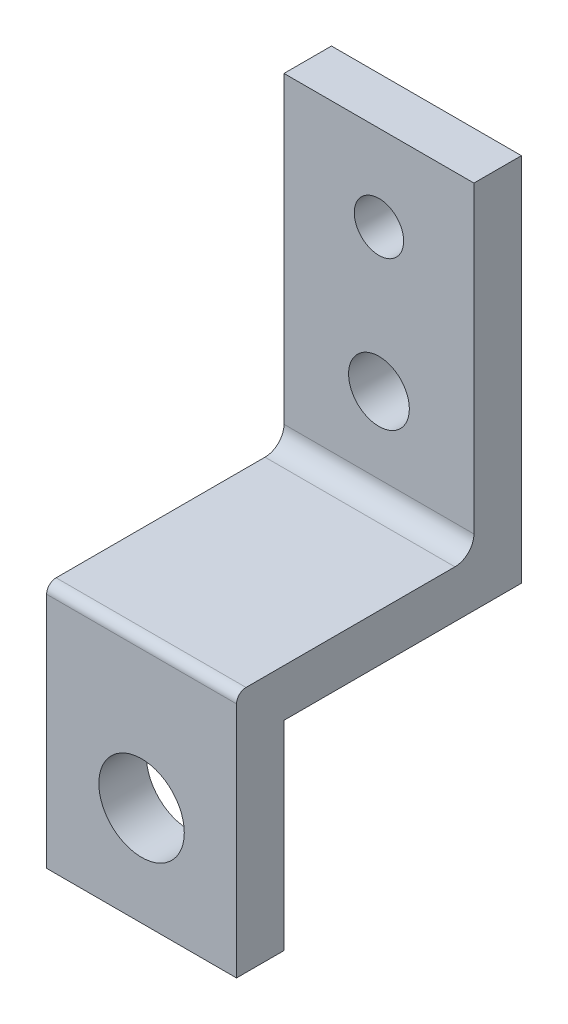
ISO-10303-21;
HEADER;
FILE_DESCRIPTION(('STEP AP214'),'2;1');
FILE_NAME('part.step','',(''),(''),'','','');
FILE_SCHEMA(('AUTOMOTIVE_DESIGN { 1 0 10303 214 1 1 1 1 }'));
ENDSEC;
DATA;
#1=APPLICATION_CONTEXT('core data for automotive mechanical design processes');
#2=APPLICATION_PROTOCOL_DEFINITION('international standard','automotive_design',2000,#1);
#3=PRODUCT_CONTEXT('',#1,'mechanical');
#4=PRODUCT('Part','Part','',(#3));
#5=PRODUCT_RELATED_PRODUCT_CATEGORY('part','',(#4));
#6=PRODUCT_DEFINITION_FORMATION('','',#4);
#7=PRODUCT_DEFINITION_CONTEXT('part definition',#1,'design');
#8=PRODUCT_DEFINITION('design','',#6,#7);
#9=PRODUCT_DEFINITION_SHAPE('','',#8);
#10=(LENGTH_UNIT() NAMED_UNIT(*) SI_UNIT(.MILLI.,.METRE.));
#11=(NAMED_UNIT(*) PLANE_ANGLE_UNIT() SI_UNIT($,.RADIAN.));
#12=(NAMED_UNIT(*) SI_UNIT($,.STERADIAN.) SOLID_ANGLE_UNIT());
#13=UNCERTAINTY_MEASURE_WITH_UNIT(LENGTH_MEASURE(1.E-05),#10,'distance_accuracy_value','');
#14=(GEOMETRIC_REPRESENTATION_CONTEXT(3) GLOBAL_UNCERTAINTY_ASSIGNED_CONTEXT((#13)) GLOBAL_UNIT_ASSIGNED_CONTEXT((#10,
#11,#12)) REPRESENTATION_CONTEXT('',''));
#15=CARTESIAN_POINT('',(0.,0.,0.));
#16=DIRECTION('',(0.,0.,1.));
#17=DIRECTION('',(1.,0.,0.));
#18=AXIS2_PLACEMENT_3D('',#15,#16,#17);
#19=CARTESIAN_POINT('',(0.,0.,0.));
#20=DIRECTION('',(0.,0.,1.));
#21=DIRECTION('',(1.,0.,0.));
#22=AXIS2_PLACEMENT_3D('',#19,#20,#21);
#23=PLANE('',#22);
#24=CARTESIAN_POINT('',(0.,-0.5,0.));
#25=DIRECTION('',(0.,0.,1.));
#26=DIRECTION('',(1.,0.,0.));
#27=AXIS2_PLACEMENT_3D('',#24,#25,#26);
#28=CIRCLE('',#27,4.5);
#29=CARTESIAN_POINT('',(4.5,-0.5,0.));
#30=VERTEX_POINT('',#29);
#31=EDGE_CURVE('E144',#30,#30,#28,.T.);
#32=ORIENTED_EDGE('',*,*,#31,.T.);
#33=EDGE_LOOP('',(#32));
#34=FACE_BOUND('',#33,.T.);
#35=DIRECTION('',(-1.,0.,0.));
#36=VECTOR('',#35,1.);
#37=CARTESIAN_POINT('',(10.,10.,0.));
#38=LINE('',#37,#36);
#39=CARTESIAN_POINT('',(10.,9.99999999999999,0.));
#40=VERTEX_POINT('',#39);
#41=CARTESIAN_POINT('',(-9.99999999999999,10.,0.));
#42=VERTEX_POINT('',#41);
#43=EDGE_CURVE('E127',#40,#42,#38,.T.);
#44=ORIENTED_EDGE('',*,*,#43,.F.);
#45=DIRECTION('',(0.,1.,0.));
#46=VECTOR('',#45,1.);
#47=CARTESIAN_POINT('',(10.,44.,0.));
#48=LINE('',#47,#46);
#49=CARTESIAN_POINT('',(10.,-11.,0.));
#50=VERTEX_POINT('',#49);
#51=EDGE_CURVE('E158',#50,#40,#48,.T.);
#52=ORIENTED_EDGE('',*,*,#51,.F.);
#53=DIRECTION('',(1.,0.,0.));
#54=VECTOR('',#53,1.);
#55=CARTESIAN_POINT('',(-10.,-11.,0.));
#56=LINE('',#55,#54);
#57=CARTESIAN_POINT('',(-10.,-11.,0.));
#58=VERTEX_POINT('',#57);
#59=EDGE_CURVE('E164',#58,#50,#56,.T.);
#60=ORIENTED_EDGE('',*,*,#59,.F.);
#61=DIRECTION('',(0.,-1.,0.));
#62=VECTOR('',#61,1.);
#63=CARTESIAN_POINT('',(-10.,-10.,0.));
#64=LINE('',#63,#62);
#65=EDGE_CURVE('E174',#42,#58,#64,.T.);
#66=ORIENTED_EDGE('',*,*,#65,.F.);
#67=EDGE_LOOP('',(#44,#52,#60,#66));
#68=FACE_BOUND('',#67,.T.);
#69=ADVANCED_FACE('F38',(#34,#68),#23,.F.);
#70=CARTESIAN_POINT('',(0.,0.,5.));
#71=DIRECTION('',(0.,0.,1.));
#72=DIRECTION('',(1.,0.,0.));
#73=AXIS2_PLACEMENT_3D('',#70,#71,#72);
#74=PLANE('',#73);
#75=DIRECTION('',(0.,1.,0.));
#76=VECTOR('',#75,1.);
#77=CARTESIAN_POINT('',(10.,-11.,5.));
#78=LINE('',#77,#76);
#79=CARTESIAN_POINT('',(10.,-11.,5.));
#80=VERTEX_POINT('',#79);
#81=CARTESIAN_POINT('',(10.,14.,5.));
#82=VERTEX_POINT('',#81);
#83=EDGE_CURVE('E160',#80,#82,#78,.T.);
#84=ORIENTED_EDGE('',*,*,#83,.T.);
#85=DIRECTION('',(1.,0.,0.));
#86=VECTOR('',#85,1.);
#87=CARTESIAN_POINT('',(-10.,14.,5.));
#88=LINE('',#87,#86);
#89=CARTESIAN_POINT('',(-10.,14.,5.));
#90=VERTEX_POINT('',#89);
#91=EDGE_CURVE('E47',#82,#90,#88,.F.);
#92=ORIENTED_EDGE('',*,*,#91,.T.);
#93=DIRECTION('',(0.,-1.,0.));
#94=VECTOR('',#93,1.);
#95=CARTESIAN_POINT('',(-10.,44.,5.));
#96=LINE('',#95,#94);
#97=CARTESIAN_POINT('',(-10.,-11.,5.));
#98=VERTEX_POINT('',#97);
#99=EDGE_CURVE('E163',#90,#98,#96,.T.);
#100=ORIENTED_EDGE('',*,*,#99,.T.);
#101=DIRECTION('',(1.,0.,0.));
#102=VECTOR('',#101,1.);
#103=CARTESIAN_POINT('',(-10.,-11.,5.));
#104=LINE('',#103,#102);
#105=EDGE_CURVE('E167',#98,#80,#104,.T.);
#106=ORIENTED_EDGE('',*,*,#105,.T.);
#107=EDGE_LOOP('',(#84,#92,#100,#106));
#108=FACE_BOUND('',#107,.T.);
#109=CARTESIAN_POINT('',(0.,-0.5,5.));
#110=DIRECTION('',(0.,0.,1.));
#111=DIRECTION('',(1.,0.,0.));
#112=AXIS2_PLACEMENT_3D('',#109,#110,#111);
#113=CIRCLE('',#112,4.5);
#114=CARTESIAN_POINT('',(4.5,-0.5,5.));
#115=VERTEX_POINT('',#114);
#116=EDGE_CURVE('E150',#115,#115,#113,.T.);
#117=ORIENTED_EDGE('',*,*,#116,.F.);
#118=EDGE_LOOP('',(#117));
#119=FACE_BOUND('',#118,.T.);
#120=ADVANCED_FACE('F271',(#108,#119),#74,.T.);
#121=CARTESIAN_POINT('',(10.,44.,5.));
#122=DIRECTION('',(-1.,0.,0.));
#123=DIRECTION('',(0.,-1.,0.));
#124=AXIS2_PLACEMENT_3D('',#121,#122,#123);
#125=PLANE('',#124);
#126=DIRECTION('',(0.,0.,-1.));
#127=VECTOR('',#126,1.);
#128=CARTESIAN_POINT('',(10.,15.,0.));
#129=LINE('',#128,#127);
#130=CARTESIAN_POINT('',(10.,15.,4.));
#131=VERTEX_POINT('',#130);
#132=CARTESIAN_POINT('',(10.,15.,-18.));
#133=VERTEX_POINT('',#132);
#134=EDGE_CURVE('E138',#131,#133,#129,.T.);
#135=ORIENTED_EDGE('',*,*,#134,.F.);
#136=CARTESIAN_POINT('',(10.,14.,4.));
#137=DIRECTION('',(-1.,0.,0.));
#138=DIRECTION('',(0.,-1.,0.));
#139=AXIS2_PLACEMENT_3D('',#136,#137,#138);
#140=CIRCLE('',#139,1.);
#141=EDGE_CURVE('E61',#131,#82,#140,.F.);
#142=ORIENTED_EDGE('',*,*,#141,.T.);
#143=ORIENTED_EDGE('',*,*,#83,.F.);
#144=DIRECTION('',(0.,0.,-1.));
#145=VECTOR('',#144,1.);
#146=CARTESIAN_POINT('',(10.,-11.,5.));
#147=LINE('',#146,#145);
#148=EDGE_CURVE('E170',#80,#50,#147,.T.);
#149=ORIENTED_EDGE('',*,*,#148,.T.);
#150=ORIENTED_EDGE('',*,*,#51,.T.);
#151=DIRECTION('',(0.,0.,1.));
#152=VECTOR('',#151,1.);
#153=CARTESIAN_POINT('',(10.,10.,-25.));
#154=LINE('',#153,#152);
#155=CARTESIAN_POINT('',(10.,10.,-25.));
#156=VERTEX_POINT('',#155);
#157=EDGE_CURVE('E152',#156,#40,#154,.T.);
#158=ORIENTED_EDGE('',*,*,#157,.F.);
#159=DIRECTION('',(0.,-1.,0.));
#160=VECTOR('',#159,1.);
#161=CARTESIAN_POINT('',(10.,49.,-25.));
#162=LINE('',#161,#160);
#163=CARTESIAN_POINT('',(10.,49.,-25.));
#164=VERTEX_POINT('',#163);
#165=EDGE_CURVE('E229',#164,#156,#162,.T.);
#166=ORIENTED_EDGE('',*,*,#165,.F.);
#167=DIRECTION('',(0.,0.,1.));
#168=VECTOR('',#167,1.);
#169=CARTESIAN_POINT('',(10.,49.,-25.));
#170=LINE('',#169,#168);
#171=CARTESIAN_POINT('',(10.,49.,-20.));
#172=VERTEX_POINT('',#171);
#173=EDGE_CURVE('E145',#164,#172,#170,.T.);
#174=ORIENTED_EDGE('',*,*,#173,.T.);
#175=DIRECTION('',(0.,1.,0.));
#176=VECTOR('',#175,1.);
#177=CARTESIAN_POINT('',(10.,15.,-20.));
#178=LINE('',#177,#176);
#179=CARTESIAN_POINT('',(10.,17.,-20.));
#180=VERTEX_POINT('',#179);
#181=EDGE_CURVE('E133',#180,#172,#178,.T.);
#182=ORIENTED_EDGE('',*,*,#181,.F.);
#183=CARTESIAN_POINT('',(10.,17.,-18.));
#184=DIRECTION('',(-1.,0.,0.));
#185=DIRECTION('',(0.,-1.,0.));
#186=AXIS2_PLACEMENT_3D('',#183,#184,#185);
#187=CIRCLE('',#186,2.);
#188=EDGE_CURVE('E197',#180,#133,#187,.T.);
#189=ORIENTED_EDGE('',*,*,#188,.T.);
#190=EDGE_LOOP('',(#135,#142,#143,#149,#150,#158,#166,#174,#182,#189));
#191=FACE_BOUND('',#190,.T.);
#192=ADVANCED_FACE('F215',(#191),#125,.F.);
#193=CARTESIAN_POINT('',(-10.,-10.,5.));
#194=DIRECTION('',(1.,0.,0.));
#195=DIRECTION('',(0.,0.,-1.));
#196=AXIS2_PLACEMENT_3D('',#193,#194,#195);
#197=PLANE('',#196);
#198=ORIENTED_EDGE('',*,*,#99,.F.);
#199=CARTESIAN_POINT('',(-10.,14.,4.));
#200=DIRECTION('',(1.,0.,0.));
#201=DIRECTION('',(0.,0.,-1.));
#202=AXIS2_PLACEMENT_3D('',#199,#200,#201);
#203=CIRCLE('',#202,1.);
#204=CARTESIAN_POINT('',(-10.,15.,4.));
#205=VERTEX_POINT('',#204);
#206=EDGE_CURVE('E11',#90,#205,#203,.F.);
#207=ORIENTED_EDGE('',*,*,#206,.T.);
#208=DIRECTION('',(0.,0.,-1.));
#209=VECTOR('',#208,1.);
#210=CARTESIAN_POINT('',(-10.,15.,5.));
#211=LINE('',#210,#209);
#212=CARTESIAN_POINT('',(-10.,15.,-18.));
#213=VERTEX_POINT('',#212);
#214=EDGE_CURVE('E187',#205,#213,#211,.T.);
#215=ORIENTED_EDGE('',*,*,#214,.T.);
#216=CARTESIAN_POINT('',(-10.,17.,-18.));
#217=DIRECTION('',(1.,0.,0.));
#218=DIRECTION('',(0.,0.,-1.));
#219=AXIS2_PLACEMENT_3D('',#216,#217,#218);
#220=CIRCLE('',#219,2.);
#221=CARTESIAN_POINT('',(-10.,17.,-20.));
#222=VERTEX_POINT('',#221);
#223=EDGE_CURVE('E122',#213,#222,#220,.T.);
#224=ORIENTED_EDGE('',*,*,#223,.T.);
#225=DIRECTION('',(0.,1.,0.));
#226=VECTOR('',#225,1.);
#227=CARTESIAN_POINT('',(-10.,-10.,-20.));
#228=LINE('',#227,#226);
#229=CARTESIAN_POINT('',(-9.99999999999999,49.,-20.));
#230=VERTEX_POINT('',#229);
#231=EDGE_CURVE('E115',#222,#230,#228,.T.);
#232=ORIENTED_EDGE('',*,*,#231,.T.);
#233=DIRECTION('',(0.,0.,1.));
#234=VECTOR('',#233,1.);
#235=CARTESIAN_POINT('',(-9.99999999999999,49.,-25.));
#236=LINE('',#235,#234);
#237=CARTESIAN_POINT('',(-9.99999999999999,49.,-25.));
#238=VERTEX_POINT('',#237);
#239=EDGE_CURVE('E120',#238,#230,#236,.T.);
#240=ORIENTED_EDGE('',*,*,#239,.F.);
#241=DIRECTION('',(0.,1.,0.));
#242=VECTOR('',#241,1.);
#243=CARTESIAN_POINT('',(-9.99999999999999,49.,-25.));
#244=LINE('',#243,#242);
#245=CARTESIAN_POINT('',(-9.99999999999999,10.,-25.));
#246=VERTEX_POINT('',#245);
#247=EDGE_CURVE('E224',#246,#238,#244,.T.);
#248=ORIENTED_EDGE('',*,*,#247,.F.);
#249=DIRECTION('',(0.,0.,1.));
#250=VECTOR('',#249,1.);
#251=CARTESIAN_POINT('',(-9.99999999999999,10.,-25.));
#252=LINE('',#251,#250);
#253=EDGE_CURVE('E235',#246,#42,#252,.T.);
#254=ORIENTED_EDGE('',*,*,#253,.T.);
#255=ORIENTED_EDGE('',*,*,#65,.T.);
#256=DIRECTION('',(0.,0.,-1.));
#257=VECTOR('',#256,1.);
#258=CARTESIAN_POINT('',(-10.,-11.,5.));
#259=LINE('',#258,#257);
#260=EDGE_CURVE('E183',#98,#58,#259,.T.);
#261=ORIENTED_EDGE('',*,*,#260,.F.);
#262=EDGE_LOOP('',(#198,#207,#215,#224,#232,#240,#248,#254,#255,#261));
#263=FACE_BOUND('',#262,.T.);
#264=ADVANCED_FACE('F117',(#263),#197,.F.);
#265=CARTESIAN_POINT('',(-10.,-11.,5.));
#266=DIRECTION('',(0.,1.,0.));
#267=DIRECTION('',(0.,0.,1.));
#268=AXIS2_PLACEMENT_3D('',#265,#266,#267);
#269=PLANE('',#268);
#270=ORIENTED_EDGE('',*,*,#59,.T.);
#271=ORIENTED_EDGE('',*,*,#148,.F.);
#272=ORIENTED_EDGE('',*,*,#105,.F.);
#273=ORIENTED_EDGE('',*,*,#260,.T.);
#274=EDGE_LOOP('',(#270,#271,#272,#273));
#275=FACE_BOUND('',#274,.T.);
#276=ADVANCED_FACE('F253',(#275),#269,.F.);
#277=CARTESIAN_POINT('',(0.,-0.5,5.));
#278=DIRECTION('',(0.,0.,-1.));
#279=DIRECTION('',(-1.,0.,0.));
#280=AXIS2_PLACEMENT_3D('',#277,#278,#279);
#281=CYLINDRICAL_SURFACE('',#280,4.5);
#282=ORIENTED_EDGE('',*,*,#116,.T.);
#283=EDGE_LOOP('',(#282));
#284=FACE_BOUND('',#283,.T.);
#285=ORIENTED_EDGE('',*,*,#31,.F.);
#286=EDGE_LOOP('',(#285));
#287=FACE_BOUND('',#286,.T.);
#288=ADVANCED_FACE('F282',(#284,#287),#281,.F.);
#289=CARTESIAN_POINT('',(10.,49.,-25.));
#290=DIRECTION('',(0.,-1.,0.));
#291=DIRECTION('',(0.,0.,-1.));
#292=AXIS2_PLACEMENT_3D('',#289,#290,#291);
#293=PLANE('',#292);
#294=ORIENTED_EDGE('',*,*,#239,.T.);
#295=DIRECTION('',(1.,0.,0.));
#296=VECTOR('',#295,1.);
#297=CARTESIAN_POINT('',(-20.,49.,-20.));
#298=LINE('',#297,#296);
#299=EDGE_CURVE('E128',#230,#172,#298,.T.);
#300=ORIENTED_EDGE('',*,*,#299,.T.);
#301=ORIENTED_EDGE('',*,*,#173,.F.);
#302=DIRECTION('',(1.,0.,0.));
#303=VECTOR('',#302,1.);
#304=CARTESIAN_POINT('',(10.,49.,-25.));
#305=LINE('',#304,#303);
#306=EDGE_CURVE('E141',#238,#164,#305,.T.);
#307=ORIENTED_EDGE('',*,*,#306,.F.);
#308=EDGE_LOOP('',(#294,#300,#301,#307));
#309=FACE_BOUND('',#308,.T.);
#310=ADVANCED_FACE('F140',(#309),#293,.F.);
#311=CARTESIAN_POINT('',(10.,10.,-25.));
#312=DIRECTION('',(0.,1.,0.));
#313=DIRECTION('',(0.,0.,1.));
#314=AXIS2_PLACEMENT_3D('',#311,#312,#313);
#315=PLANE('',#314);
#316=ORIENTED_EDGE('',*,*,#43,.T.);
#317=ORIENTED_EDGE('',*,*,#253,.F.);
#318=DIRECTION('',(-1.,0.,0.));
#319=VECTOR('',#318,1.);
#320=CARTESIAN_POINT('',(10.,10.,-25.));
#321=LINE('',#320,#319);
#322=EDGE_CURVE('E232',#156,#246,#321,.T.);
#323=ORIENTED_EDGE('',*,*,#322,.F.);
#324=ORIENTED_EDGE('',*,*,#157,.T.);
#325=EDGE_LOOP('',(#316,#317,#323,#324));
#326=FACE_BOUND('',#325,.T.);
#327=ADVANCED_FACE('F246',(#326),#315,.F.);
#328=CARTESIAN_POINT('',(0.,0.,-25.));
#329=DIRECTION('',(0.,0.,-1.));
#330=DIRECTION('',(-1.,0.,0.));
#331=AXIS2_PLACEMENT_3D('',#328,#329,#330);
#332=PLANE('',#331);
#333=CARTESIAN_POINT('',(0.,40.,-25.));
#334=DIRECTION('',(0.,0.,-1.));
#335=DIRECTION('',(-1.,0.,0.));
#336=AXIS2_PLACEMENT_3D('',#333,#334,#335);
#337=CIRCLE('',#336,2.6);
#338=CARTESIAN_POINT('',(-2.6,40.,-25.));
#339=VERTEX_POINT('',#338);
#340=EDGE_CURVE('E220',#339,#339,#337,.T.);
#341=ORIENTED_EDGE('',*,*,#340,.F.);
#342=EDGE_LOOP('',(#341));
#343=FACE_BOUND('',#342,.T.);
#344=CARTESIAN_POINT('',(0.,25.,-25.));
#345=DIRECTION('',(0.,0.,-1.));
#346=DIRECTION('',(-1.,0.,0.));
#347=AXIS2_PLACEMENT_3D('',#344,#345,#346);
#348=CIRCLE('',#347,3.2);
#349=CARTESIAN_POINT('',(-3.2,25.,-25.));
#350=VERTEX_POINT('',#349);
#351=EDGE_CURVE('E319',#350,#350,#348,.T.);
#352=ORIENTED_EDGE('',*,*,#351,.F.);
#353=EDGE_LOOP('',(#352));
#354=FACE_BOUND('',#353,.T.);
#355=ORIENTED_EDGE('',*,*,#247,.T.);
#356=ORIENTED_EDGE('',*,*,#306,.T.);
#357=ORIENTED_EDGE('',*,*,#165,.T.);
#358=ORIENTED_EDGE('',*,*,#322,.T.);
#359=EDGE_LOOP('',(#355,#356,#357,#358));
#360=FACE_BOUND('',#359,.T.);
#361=ADVANCED_FACE('F257',(#343,#354,#360),#332,.T.);
#362=CARTESIAN_POINT('',(-20.,15.,0.));
#363=DIRECTION('',(0.,-1.,0.));
#364=DIRECTION('',(1.,0.,0.));
#365=AXIS2_PLACEMENT_3D('',#362,#363,#364);
#366=PLANE('',#365);
#367=ORIENTED_EDGE('',*,*,#214,.F.);
#368=DIRECTION('',(1.,0.,0.));
#369=VECTOR('',#368,1.);
#370=CARTESIAN_POINT('',(9.99999999999999,15.,4.));
#371=LINE('',#370,#369);
#372=EDGE_CURVE('E203',#205,#131,#371,.T.);
#373=ORIENTED_EDGE('',*,*,#372,.T.);
#374=ORIENTED_EDGE('',*,*,#134,.T.);
#375=DIRECTION('',(1.,0.,0.));
#376=VECTOR('',#375,1.);
#377=CARTESIAN_POINT('',(-10.,15.,-18.));
#378=LINE('',#377,#376);
#379=EDGE_CURVE('E193',#133,#213,#378,.F.);
#380=ORIENTED_EDGE('',*,*,#379,.T.);
#381=EDGE_LOOP('',(#367,#373,#374,#380));
#382=FACE_BOUND('',#381,.T.);
#383=ADVANCED_FACE('F212',(#382),#366,.F.);
#384=CARTESIAN_POINT('',(-20.,15.,-20.));
#385=DIRECTION('',(0.,0.,-1.));
#386=DIRECTION('',(-1.,0.,0.));
#387=AXIS2_PLACEMENT_3D('',#384,#385,#386);
#388=PLANE('',#387);
#389=CARTESIAN_POINT('',(0.,40.,-20.));
#390=DIRECTION('',(0.,0.,1.));
#391=DIRECTION('',(1.,0.,0.));
#392=AXIS2_PLACEMENT_3D('',#389,#390,#391);
#393=CIRCLE('',#392,2.6);
#394=CARTESIAN_POINT('',(2.6,40.,-20.));
#395=VERTEX_POINT('',#394);
#396=EDGE_CURVE('E311',#395,#395,#393,.T.);
#397=ORIENTED_EDGE('',*,*,#396,.F.);
#398=EDGE_LOOP('',(#397));
#399=FACE_BOUND('',#398,.T.);
#400=CARTESIAN_POINT('',(0.,25.,-20.));
#401=DIRECTION('',(0.,0.,1.));
#402=DIRECTION('',(1.,0.,0.));
#403=AXIS2_PLACEMENT_3D('',#400,#401,#402);
#404=CIRCLE('',#403,3.2);
#405=CARTESIAN_POINT('',(3.2,25.,-20.));
#406=VERTEX_POINT('',#405);
#407=EDGE_CURVE('E314',#406,#406,#404,.T.);
#408=ORIENTED_EDGE('',*,*,#407,.F.);
#409=EDGE_LOOP('',(#408));
#410=FACE_BOUND('',#409,.T.);
#411=ORIENTED_EDGE('',*,*,#231,.F.);
#412=DIRECTION('',(1.,0.,0.));
#413=VECTOR('',#412,1.);
#414=CARTESIAN_POINT('',(9.99999999999999,17.,-20.));
#415=LINE('',#414,#413);
#416=EDGE_CURVE('E190',#222,#180,#415,.T.);
#417=ORIENTED_EDGE('',*,*,#416,.T.);
#418=ORIENTED_EDGE('',*,*,#181,.T.);
#419=ORIENTED_EDGE('',*,*,#299,.F.);
#420=EDGE_LOOP('',(#411,#417,#418,#419));
#421=FACE_BOUND('',#420,.T.);
#422=ADVANCED_FACE('F131',(#399,#410,#421),#388,.F.);
#423=CARTESIAN_POINT('',(0.,25.,-30.));
#424=DIRECTION('',(0.,0.,1.));
#425=DIRECTION('',(1.,0.,0.));
#426=AXIS2_PLACEMENT_3D('',#423,#424,#425);
#427=CYLINDRICAL_SURFACE('',#426,3.2);
#428=ORIENTED_EDGE('',*,*,#351,.T.);
#429=EDGE_LOOP('',(#428));
#430=FACE_BOUND('',#429,.T.);
#431=ORIENTED_EDGE('',*,*,#407,.T.);
#432=EDGE_LOOP('',(#431));
#433=FACE_BOUND('',#432,.T.);
#434=ADVANCED_FACE('F294',(#430,#433),#427,.F.);
#435=CARTESIAN_POINT('',(0.,40.,-30.));
#436=DIRECTION('',(0.,0.,1.));
#437=DIRECTION('',(1.,0.,0.));
#438=AXIS2_PLACEMENT_3D('',#435,#436,#437);
#439=CYLINDRICAL_SURFACE('',#438,2.6);
#440=ORIENTED_EDGE('',*,*,#340,.T.);
#441=EDGE_LOOP('',(#440));
#442=FACE_BOUND('',#441,.T.);
#443=ORIENTED_EDGE('',*,*,#396,.T.);
#444=EDGE_LOOP('',(#443));
#445=FACE_BOUND('',#444,.T.);
#446=ADVANCED_FACE('F288',(#442,#445),#439,.F.);
#447=CARTESIAN_POINT('',(-20.,17.,-18.));
#448=DIRECTION('',(-1.,0.,0.));
#449=DIRECTION('',(0.,-1.,0.));
#450=AXIS2_PLACEMENT_3D('',#447,#448,#449);
#451=CYLINDRICAL_SURFACE('',#450,2.);
#452=ORIENTED_EDGE('',*,*,#223,.F.);
#453=ORIENTED_EDGE('',*,*,#379,.F.);
#454=ORIENTED_EDGE('',*,*,#188,.F.);
#455=ORIENTED_EDGE('',*,*,#416,.F.);
#456=EDGE_LOOP('',(#452,#453,#454,#455));
#457=FACE_BOUND('',#456,.T.);
#458=ADVANCED_FACE('F286',(#457),#451,.F.);
#459=CARTESIAN_POINT('',(-20.,14.,4.));
#460=DIRECTION('',(-1.,0.,0.));
#461=DIRECTION('',(0.,-1.,0.));
#462=AXIS2_PLACEMENT_3D('',#459,#460,#461);
#463=CYLINDRICAL_SURFACE('',#462,1.);
#464=ORIENTED_EDGE('',*,*,#206,.F.);
#465=ORIENTED_EDGE('',*,*,#91,.F.);
#466=ORIENTED_EDGE('',*,*,#141,.F.);
#467=ORIENTED_EDGE('',*,*,#372,.F.);
#468=EDGE_LOOP('',(#464,#465,#466,#467));
#469=FACE_BOUND('',#468,.T.);
#470=ADVANCED_FACE('F40',(#469),#463,.T.);
#471=CLOSED_SHELL('',(#69,#120,#192,#264,#276,#288,#310,#327,#361,#383,#422,#434,#446,#458,#470));
#472=MANIFOLD_SOLID_BREP('B2',#471);
#473=ADVANCED_BREP_SHAPE_REPRESENTATION('',(#18,#472),#14);
#474=SHAPE_DEFINITION_REPRESENTATION(#9,#473);
ENDSEC;
END-ISO-10303-21;
